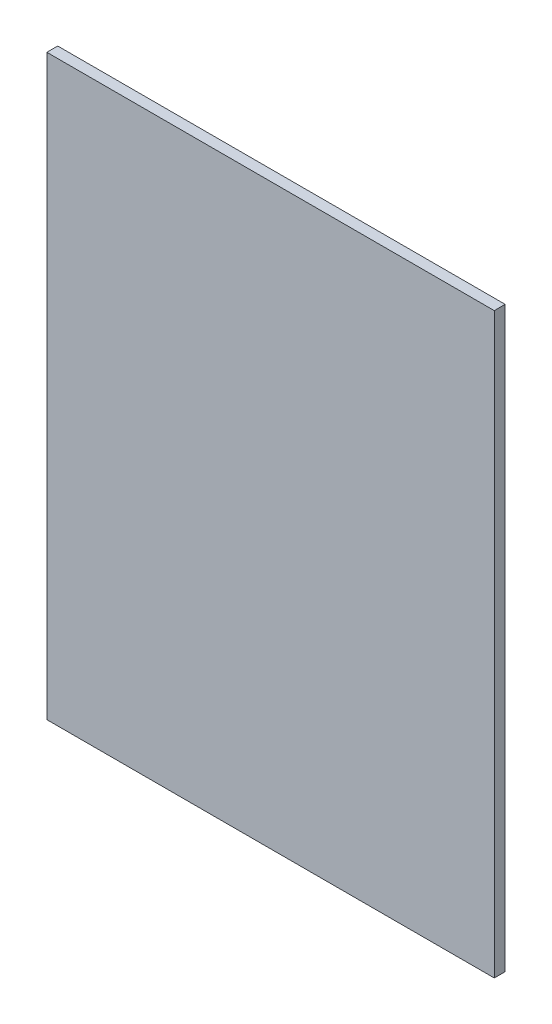
ISO-10303-21;
HEADER;
FILE_DESCRIPTION(('STEP AP214'),'2;1');
FILE_NAME('part.step','',(''),(''),'','','');
FILE_SCHEMA(('AUTOMOTIVE_DESIGN { 1 0 10303 214 1 1 1 1 }'));
ENDSEC;
DATA;
#1=APPLICATION_CONTEXT('core data for automotive mechanical design processes');
#2=APPLICATION_PROTOCOL_DEFINITION('international standard','automotive_design',2000,#1);
#3=PRODUCT_CONTEXT('',#1,'mechanical');
#4=PRODUCT('Part','Part','',(#3));
#5=PRODUCT_RELATED_PRODUCT_CATEGORY('part','',(#4));
#6=PRODUCT_DEFINITION_FORMATION('','',#4);
#7=PRODUCT_DEFINITION_CONTEXT('part definition',#1,'design');
#8=PRODUCT_DEFINITION('design','',#6,#7);
#9=PRODUCT_DEFINITION_SHAPE('','',#8);
#10=(LENGTH_UNIT() NAMED_UNIT(*) SI_UNIT(.MILLI.,.METRE.));
#11=(NAMED_UNIT(*) PLANE_ANGLE_UNIT() SI_UNIT($,.RADIAN.));
#12=(NAMED_UNIT(*) SI_UNIT($,.STERADIAN.) SOLID_ANGLE_UNIT());
#13=UNCERTAINTY_MEASURE_WITH_UNIT(LENGTH_MEASURE(1.E-05),#10,'distance_accuracy_value','');
#14=(GEOMETRIC_REPRESENTATION_CONTEXT(3) GLOBAL_UNCERTAINTY_ASSIGNED_CONTEXT((#13)) GLOBAL_UNIT_ASSIGNED_CONTEXT((#10,
#11,#12)) REPRESENTATION_CONTEXT('',''));
#15=CARTESIAN_POINT('',(0.,0.,0.));
#16=DIRECTION('',(0.,0.,1.));
#17=DIRECTION('',(1.,0.,0.));
#18=AXIS2_PLACEMENT_3D('',#15,#16,#17);
#19=CARTESIAN_POINT('',(0.,0.,16.));
#20=DIRECTION('',(1.,0.,0.));
#21=DIRECTION('',(0.,0.,-1.));
#22=AXIS2_PLACEMENT_3D('',#19,#20,#21);
#23=PLANE('',#22);
#24=DIRECTION('',(0.,-1.,0.));
#25=VECTOR('',#24,1.);
#26=CARTESIAN_POINT('',(0.,0.,0.));
#27=LINE('',#26,#25);
#28=CARTESIAN_POINT('',(0.,850.,0.));
#29=VERTEX_POINT('',#28);
#30=CARTESIAN_POINT('',(0.,0.,0.));
#31=VERTEX_POINT('',#30);
#32=EDGE_CURVE('E94',#29,#31,#27,.T.);
#33=ORIENTED_EDGE('',*,*,#32,.T.);
#34=DIRECTION('',(0.,0.,-1.));
#35=VECTOR('',#34,1.);
#36=CARTESIAN_POINT('',(0.,0.,16.));
#37=LINE('',#36,#35);
#38=CARTESIAN_POINT('',(0.,0.,16.));
#39=VERTEX_POINT('',#38);
#40=EDGE_CURVE('E11',#39,#31,#37,.T.);
#41=ORIENTED_EDGE('',*,*,#40,.F.);
#42=DIRECTION('',(0.,-1.,0.));
#43=VECTOR('',#42,1.);
#44=CARTESIAN_POINT('',(0.,0.,16.));
#45=LINE('',#44,#43);
#46=CARTESIAN_POINT('',(0.,850.,16.));
#47=VERTEX_POINT('',#46);
#48=EDGE_CURVE('E82',#47,#39,#45,.T.);
#49=ORIENTED_EDGE('',*,*,#48,.F.);
#50=DIRECTION('',(0.,0.,-1.));
#51=VECTOR('',#50,1.);
#52=CARTESIAN_POINT('',(0.,850.,16.));
#53=LINE('',#52,#51);
#54=EDGE_CURVE('E90',#47,#29,#53,.T.);
#55=ORIENTED_EDGE('',*,*,#54,.T.);
#56=EDGE_LOOP('',(#33,#41,#49,#55));
#57=FACE_BOUND('',#56,.T.);
#58=ADVANCED_FACE('F31',(#57),#23,.F.);
#59=CARTESIAN_POINT('',(0.,0.,16.));
#60=DIRECTION('',(0.,1.,0.));
#61=DIRECTION('',(0.,0.,1.));
#62=AXIS2_PLACEMENT_3D('',#59,#60,#61);
#63=PLANE('',#62);
#64=DIRECTION('',(1.,0.,0.));
#65=VECTOR('',#64,1.);
#66=CARTESIAN_POINT('',(0.,0.,0.));
#67=LINE('',#66,#65);
#68=CARTESIAN_POINT('',(658.,0.,0.));
#69=VERTEX_POINT('',#68);
#70=EDGE_CURVE('E86',#31,#69,#67,.T.);
#71=ORIENTED_EDGE('',*,*,#70,.T.);
#72=DIRECTION('',(0.,0.,-1.));
#73=VECTOR('',#72,1.);
#74=CARTESIAN_POINT('',(658.,0.,16.));
#75=LINE('',#74,#73);
#76=CARTESIAN_POINT('',(658.,0.,16.));
#77=VERTEX_POINT('',#76);
#78=EDGE_CURVE('E39',#77,#69,#75,.T.);
#79=ORIENTED_EDGE('',*,*,#78,.F.);
#80=DIRECTION('',(1.,0.,0.));
#81=VECTOR('',#80,1.);
#82=CARTESIAN_POINT('',(0.,0.,16.));
#83=LINE('',#82,#81);
#84=EDGE_CURVE('E77',#39,#77,#83,.T.);
#85=ORIENTED_EDGE('',*,*,#84,.F.);
#86=ORIENTED_EDGE('',*,*,#40,.T.);
#87=EDGE_LOOP('',(#71,#79,#85,#86));
#88=FACE_BOUND('',#87,.T.);
#89=ADVANCED_FACE('F85',(#88),#63,.F.);
#90=CARTESIAN_POINT('',(658.,0.,16.));
#91=DIRECTION('',(-1.,0.,0.));
#92=DIRECTION('',(0.,0.,1.));
#93=AXIS2_PLACEMENT_3D('',#90,#91,#92);
#94=PLANE('',#93);
#95=DIRECTION('',(0.,1.,0.));
#96=VECTOR('',#95,1.);
#97=CARTESIAN_POINT('',(658.,0.,0.));
#98=LINE('',#97,#96);
#99=CARTESIAN_POINT('',(658.,850.,0.));
#100=VERTEX_POINT('',#99);
#101=EDGE_CURVE('E64',#69,#100,#98,.T.);
#102=ORIENTED_EDGE('',*,*,#101,.T.);
#103=DIRECTION('',(0.,0.,-1.));
#104=VECTOR('',#103,1.);
#105=CARTESIAN_POINT('',(658.,850.,16.));
#106=LINE('',#105,#104);
#107=CARTESIAN_POINT('',(658.,850.,16.));
#108=VERTEX_POINT('',#107);
#109=EDGE_CURVE('E87',#108,#100,#106,.T.);
#110=ORIENTED_EDGE('',*,*,#109,.F.);
#111=DIRECTION('',(0.,1.,0.));
#112=VECTOR('',#111,1.);
#113=CARTESIAN_POINT('',(658.,0.,16.));
#114=LINE('',#113,#112);
#115=EDGE_CURVE('E80',#77,#108,#114,.T.);
#116=ORIENTED_EDGE('',*,*,#115,.F.);
#117=ORIENTED_EDGE('',*,*,#78,.T.);
#118=EDGE_LOOP('',(#102,#110,#116,#117));
#119=FACE_BOUND('',#118,.T.);
#120=ADVANCED_FACE('F88',(#119),#94,.F.);
#121=CARTESIAN_POINT('',(0.,850.,16.));
#122=DIRECTION('',(0.,-1.,0.));
#123=DIRECTION('',(0.,0.,-1.));
#124=AXIS2_PLACEMENT_3D('',#121,#122,#123);
#125=PLANE('',#124);
#126=DIRECTION('',(-1.,0.,0.));
#127=VECTOR('',#126,1.);
#128=CARTESIAN_POINT('',(0.,850.,0.));
#129=LINE('',#128,#127);
#130=EDGE_CURVE('E70',#100,#29,#129,.T.);
#131=ORIENTED_EDGE('',*,*,#130,.T.);
#132=ORIENTED_EDGE('',*,*,#54,.F.);
#133=DIRECTION('',(-1.,0.,0.));
#134=VECTOR('',#133,1.);
#135=CARTESIAN_POINT('',(0.,850.,16.));
#136=LINE('',#135,#134);
#137=EDGE_CURVE('E47',#108,#47,#136,.T.);
#138=ORIENTED_EDGE('',*,*,#137,.F.);
#139=ORIENTED_EDGE('',*,*,#109,.T.);
#140=EDGE_LOOP('',(#131,#132,#138,#139));
#141=FACE_BOUND('',#140,.T.);
#142=ADVANCED_FACE('F101',(#141),#125,.F.);
#143=CARTESIAN_POINT('',(0.,850.,16.));
#144=DIRECTION('',(0.,0.,-1.));
#145=DIRECTION('',(-1.,0.,0.));
#146=AXIS2_PLACEMENT_3D('',#143,#144,#145);
#147=PLANE('',#146);
#148=ORIENTED_EDGE('',*,*,#48,.T.);
#149=ORIENTED_EDGE('',*,*,#84,.T.);
#150=ORIENTED_EDGE('',*,*,#115,.T.);
#151=ORIENTED_EDGE('',*,*,#137,.T.);
#152=EDGE_LOOP('',(#148,#149,#150,#151));
#153=FACE_BOUND('',#152,.T.);
#154=ADVANCED_FACE('F78',(#153),#147,.F.);
#155=CARTESIAN_POINT('',(0.,850.,0.));
#156=DIRECTION('',(0.,0.,-1.));
#157=DIRECTION('',(-1.,0.,0.));
#158=AXIS2_PLACEMENT_3D('',#155,#156,#157);
#159=PLANE('',#158);
#160=ORIENTED_EDGE('',*,*,#32,.F.);
#161=ORIENTED_EDGE('',*,*,#130,.F.);
#162=ORIENTED_EDGE('',*,*,#101,.F.);
#163=ORIENTED_EDGE('',*,*,#70,.F.);
#164=EDGE_LOOP('',(#160,#161,#162,#163));
#165=FACE_BOUND('',#164,.T.);
#166=ADVANCED_FACE('F104',(#165),#159,.T.);
#167=CLOSED_SHELL('',(#58,#89,#120,#142,#154,#166));
#168=MANIFOLD_SOLID_BREP('B2',#167);
#169=ADVANCED_BREP_SHAPE_REPRESENTATION('',(#18,#168),#14);
#170=SHAPE_DEFINITION_REPRESENTATION(#9,#169);
ENDSEC;
END-ISO-10303-21;
